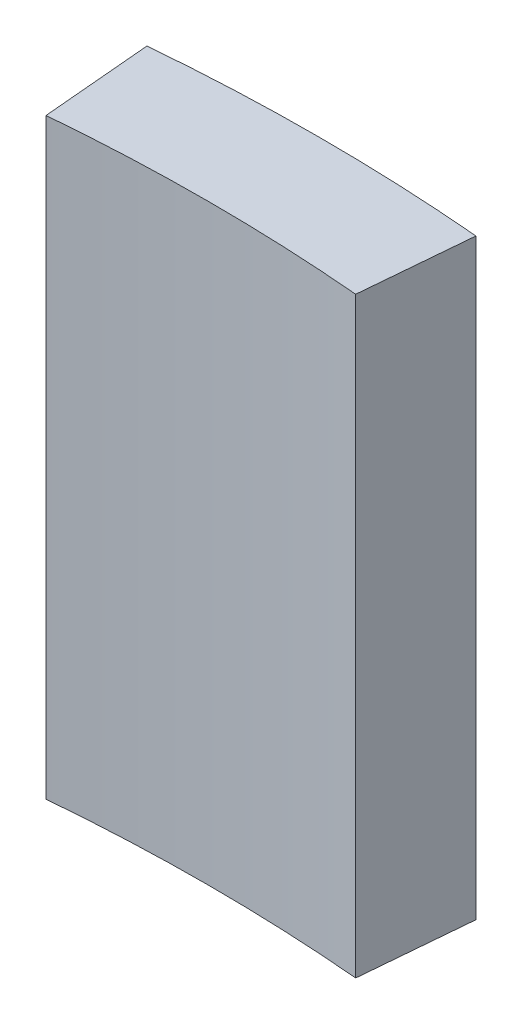
ISO-10303-21;
HEADER;
FILE_DESCRIPTION(('STEP AP214'),'2;1');
FILE_NAME('part.step','',(''),(''),'','','');
FILE_SCHEMA(('AUTOMOTIVE_DESIGN { 1 0 10303 214 1 1 1 1 }'));
ENDSEC;
DATA;
#1=APPLICATION_CONTEXT('core data for automotive mechanical design processes');
#2=APPLICATION_PROTOCOL_DEFINITION('international standard','automotive_design',2000,#1);
#3=PRODUCT_CONTEXT('',#1,'mechanical');
#4=PRODUCT('Part','Part','',(#3));
#5=PRODUCT_RELATED_PRODUCT_CATEGORY('part','',(#4));
#6=PRODUCT_DEFINITION_FORMATION('','',#4);
#7=PRODUCT_DEFINITION_CONTEXT('part definition',#1,'design');
#8=PRODUCT_DEFINITION('design','',#6,#7);
#9=PRODUCT_DEFINITION_SHAPE('','',#8);
#10=(LENGTH_UNIT() NAMED_UNIT(*) SI_UNIT(.MILLI.,.METRE.));
#11=(NAMED_UNIT(*) PLANE_ANGLE_UNIT() SI_UNIT($,.RADIAN.));
#12=(NAMED_UNIT(*) SI_UNIT($,.STERADIAN.) SOLID_ANGLE_UNIT());
#13=UNCERTAINTY_MEASURE_WITH_UNIT(LENGTH_MEASURE(1.E-05),#10,'distance_accuracy_value','');
#14=(GEOMETRIC_REPRESENTATION_CONTEXT(3) GLOBAL_UNCERTAINTY_ASSIGNED_CONTEXT((#13)) GLOBAL_UNIT_ASSIGNED_CONTEXT((#10,
#11,#12)) REPRESENTATION_CONTEXT('',''));
#15=CARTESIAN_POINT('',(0.,0.,0.));
#16=DIRECTION('',(0.,0.,1.));
#17=DIRECTION('',(1.,0.,0.));
#18=AXIS2_PLACEMENT_3D('',#15,#16,#17);
#19=CARTESIAN_POINT('',(0.,50.7999999999998,0.));
#20=DIRECTION('',(0.,-1.,0.));
#21=DIRECTION('',(0.,0.,-1.00000000000003));
#22=AXIS2_PLACEMENT_3D('',#19,#20,#21);
#23=CYLINDRICAL_SURFACE('',#22,152.4);
#24=DIRECTION('',(0.,-1.,0.));
#25=VECTOR('',#24,1.);
#26=CARTESIAN_POINT('',(13.2825351947436,50.8000000000001,-151.820071989187));
#27=LINE('',#26,#25);
#28=CARTESIAN_POINT('',(13.2825351947436,50.8000000000001,-151.820071989187));
#29=VERTEX_POINT('',#28);
#30=CARTESIAN_POINT('',(13.2825351947434,0.,-151.820071989187));
#31=VERTEX_POINT('',#30);
#32=EDGE_CURVE('E65',#29,#31,#27,.T.);
#33=ORIENTED_EDGE('',*,*,#32,.F.);
#34=CARTESIAN_POINT('',(0.,50.7999999999998,0.));
#35=DIRECTION('',(0.,1.,0.));
#36=DIRECTION('',(0.,0.,1.00000000000003));
#37=AXIS2_PLACEMENT_3D('',#34,#35,#36);
#38=CIRCLE('',#37,152.4);
#39=CARTESIAN_POINT('',(-13.2825351947436,50.8000000000001,-151.820071989187));
#40=VERTEX_POINT('',#39);
#41=EDGE_CURVE('E100',#29,#40,#38,.T.);
#42=ORIENTED_EDGE('',*,*,#41,.T.);
#43=DIRECTION('',(0.,-1.,0.));
#44=VECTOR('',#43,1.);
#45=CARTESIAN_POINT('',(-13.2825351947435,50.8000000000001,-151.820071989186));
#46=LINE('',#45,#44);
#47=CARTESIAN_POINT('',(-13.2825351947435,2.35922392732846E-13,-151.820071989186));
#48=VERTEX_POINT('',#47);
#49=EDGE_CURVE('E97',#48,#40,#46,.F.);
#50=ORIENTED_EDGE('',*,*,#49,.F.);
#51=CARTESIAN_POINT('',(0.,0.,0.));
#52=DIRECTION('',(0.,1.,0.));
#53=DIRECTION('',(0.,0.,1.00000000000003));
#54=AXIS2_PLACEMENT_3D('',#51,#52,#53);
#55=CIRCLE('',#54,152.4);
#56=EDGE_CURVE('E101',#31,#48,#55,.T.);
#57=ORIENTED_EDGE('',*,*,#56,.F.);
#58=EDGE_LOOP('',(#33,#42,#50,#57));
#59=FACE_BOUND('',#58,.T.);
#60=ADVANCED_FACE('F44',(#59),#23,.F.);
#61=CARTESIAN_POINT('',(0.,50.7999999999998,0.));
#62=DIRECTION('',(0.,-1.,0.));
#63=DIRECTION('',(0.,0.,-1.00000000000003));
#64=AXIS2_PLACEMENT_3D('',#61,#62,#63);
#65=CYLINDRICAL_SURFACE('',#64,161.925);
#66=CARTESIAN_POINT('',(0.,50.7999999999998,0.));
#67=DIRECTION('',(0.,1.,0.));
#68=DIRECTION('',(0.,0.,1.00000000000003));
#69=AXIS2_PLACEMENT_3D('',#66,#67,#68);
#70=CIRCLE('',#69,161.925);
#71=CARTESIAN_POINT('',(14.1126936444151,50.7999999999998,-161.308826488511));
#72=VERTEX_POINT('',#71);
#73=CARTESIAN_POINT('',(-14.1126936444151,50.8000000000001,-161.308826488511));
#74=VERTEX_POINT('',#73);
#75=EDGE_CURVE('E51',#72,#74,#70,.T.);
#76=ORIENTED_EDGE('',*,*,#75,.F.);
#77=DIRECTION('',(0.,1.,0.));
#78=VECTOR('',#77,1.);
#79=CARTESIAN_POINT('',(14.1126936444152,0.,-161.308826488511));
#80=LINE('',#79,#78);
#81=CARTESIAN_POINT('',(14.1126936444152,0.,-161.308826488511));
#82=VERTEX_POINT('',#81);
#83=EDGE_CURVE('E83',#82,#72,#80,.T.);
#84=ORIENTED_EDGE('',*,*,#83,.F.);
#85=CARTESIAN_POINT('',(0.,0.,0.));
#86=DIRECTION('',(0.,1.,0.));
#87=DIRECTION('',(0.,0.,1.00000000000003));
#88=AXIS2_PLACEMENT_3D('',#85,#86,#87);
#89=CIRCLE('',#88,161.925);
#90=CARTESIAN_POINT('',(-14.1126936444151,2.35922392732846E-13,-161.308826488511));
#91=VERTEX_POINT('',#90);
#92=EDGE_CURVE('E95',#82,#91,#89,.T.);
#93=ORIENTED_EDGE('',*,*,#92,.T.);
#94=DIRECTION('',(0.,1.,0.));
#95=VECTOR('',#94,1.);
#96=CARTESIAN_POINT('',(-14.1126936444151,2.35922392732846E-13,-161.308826488511));
#97=LINE('',#96,#95);
#98=EDGE_CURVE('E58',#91,#74,#97,.T.);
#99=ORIENTED_EDGE('',*,*,#98,.T.);
#100=EDGE_LOOP('',(#76,#84,#93,#99));
#101=FACE_BOUND('',#100,.T.);
#102=ADVANCED_FACE('F94',(#101),#65,.T.);
#103=CARTESIAN_POINT('',(0.,50.7999999999998,0.));
#104=DIRECTION('',(0.,1.,0.));
#105=DIRECTION('',(0.,0.,1.00000000000003));
#106=AXIS2_PLACEMENT_3D('',#103,#104,#105);
#107=PLANE('',#106);
#108=DIRECTION('',(-0.087155742747661,0.,0.996194698091774));
#109=VECTOR('',#108,1.);
#110=CARTESIAN_POINT('',(0.,50.7999999999998,0.));
#111=LINE('',#110,#109);
#112=EDGE_CURVE('E111',#72,#29,#111,.T.);
#113=ORIENTED_EDGE('',*,*,#112,.F.);
#114=ORIENTED_EDGE('',*,*,#75,.T.);
#115=DIRECTION('',(-0.0871557427476611,0.,-0.996194698091775));
#116=VECTOR('',#115,1.);
#117=CARTESIAN_POINT('',(0.,50.7999999999998,0.));
#118=LINE('',#117,#116);
#119=EDGE_CURVE('E89',#40,#74,#118,.T.);
#120=ORIENTED_EDGE('',*,*,#119,.F.);
#121=ORIENTED_EDGE('',*,*,#41,.F.);
#122=EDGE_LOOP('',(#113,#114,#120,#121));
#123=FACE_BOUND('',#122,.T.);
#124=ADVANCED_FACE('F117',(#123),#107,.T.);
#125=CARTESIAN_POINT('',(0.,0.,0.));
#126=DIRECTION('',(0.,1.,0.));
#127=DIRECTION('',(0.,0.,1.00000000000003));
#128=AXIS2_PLACEMENT_3D('',#125,#126,#127);
#129=PLANE('',#128);
#130=ORIENTED_EDGE('',*,*,#92,.F.);
#131=DIRECTION('',(-0.087155742747661,0.,0.996194698091774));
#132=VECTOR('',#131,1.);
#133=CARTESIAN_POINT('',(0.,0.,0.));
#134=LINE('',#133,#132);
#135=EDGE_CURVE('E80',#82,#31,#134,.T.);
#136=ORIENTED_EDGE('',*,*,#135,.T.);
#137=ORIENTED_EDGE('',*,*,#56,.T.);
#138=DIRECTION('',(-0.0871557427476611,0.,-0.996194698091775));
#139=VECTOR('',#138,1.);
#140=CARTESIAN_POINT('',(0.,0.,0.));
#141=LINE('',#140,#139);
#142=EDGE_CURVE('E12',#48,#91,#141,.T.);
#143=ORIENTED_EDGE('',*,*,#142,.T.);
#144=EDGE_LOOP('',(#130,#136,#137,#143));
#145=FACE_BOUND('',#144,.T.);
#146=ADVANCED_FACE('F99',(#145),#129,.F.);
#147=CARTESIAN_POINT('',(0.,0.,0.));
#148=DIRECTION('',(0.996194698091775,0.,-0.0871557427476616));
#149=DIRECTION('',(-0.0871557427476611,0.,-0.996194698091775));
#150=AXIS2_PLACEMENT_3D('',#147,#148,#149);
#151=PLANE('',#150);
#152=ORIENTED_EDGE('',*,*,#49,.T.);
#153=ORIENTED_EDGE('',*,*,#119,.T.);
#154=ORIENTED_EDGE('',*,*,#98,.F.);
#155=ORIENTED_EDGE('',*,*,#142,.F.);
#156=EDGE_LOOP('',(#152,#153,#154,#155));
#157=FACE_BOUND('',#156,.T.);
#158=ADVANCED_FACE('F118',(#157),#151,.F.);
#159=CARTESIAN_POINT('',(0.,0.,0.));
#160=DIRECTION('',(-0.996194698091774,0.,-0.0871557427476612));
#161=DIRECTION('',(-0.0871557427476612,0.,0.996194698091774));
#162=AXIS2_PLACEMENT_3D('',#159,#160,#161);
#163=PLANE('',#162);
#164=ORIENTED_EDGE('',*,*,#32,.T.);
#165=ORIENTED_EDGE('',*,*,#135,.F.);
#166=ORIENTED_EDGE('',*,*,#83,.T.);
#167=ORIENTED_EDGE('',*,*,#112,.T.);
#168=EDGE_LOOP('',(#164,#165,#166,#167));
#169=FACE_BOUND('',#168,.T.);
#170=ADVANCED_FACE('F82',(#169),#163,.F.);
#171=CLOSED_SHELL('',(#60,#102,#124,#146,#158,#170));
#172=MANIFOLD_SOLID_BREP('B2',#171);
#173=ADVANCED_BREP_SHAPE_REPRESENTATION('',(#18,#172),#14);
#174=SHAPE_DEFINITION_REPRESENTATION(#9,#173);
ENDSEC;
END-ISO-10303-21;
